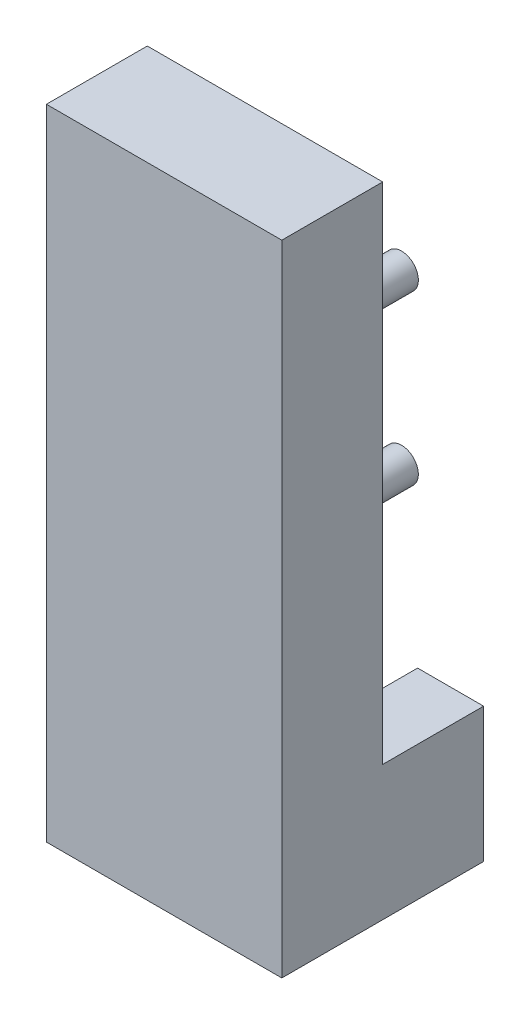
ISO-10303-21;
HEADER;
FILE_DESCRIPTION(('STEP AP214'),'2;1');
FILE_NAME('part.step','',(''),(''),'','','');
FILE_SCHEMA(('AUTOMOTIVE_DESIGN { 1 0 10303 214 1 1 1 1 }'));
ENDSEC;
DATA;
#1=APPLICATION_CONTEXT('core data for automotive mechanical design processes');
#2=APPLICATION_PROTOCOL_DEFINITION('international standard','automotive_design',2000,#1);
#3=PRODUCT_CONTEXT('',#1,'mechanical');
#4=PRODUCT('Part','Part','',(#3));
#5=PRODUCT_RELATED_PRODUCT_CATEGORY('part','',(#4));
#6=PRODUCT_DEFINITION_FORMATION('','',#4);
#7=PRODUCT_DEFINITION_CONTEXT('part definition',#1,'design');
#8=PRODUCT_DEFINITION('design','',#6,#7);
#9=PRODUCT_DEFINITION_SHAPE('','',#8);
#10=(LENGTH_UNIT() NAMED_UNIT(*) SI_UNIT(.MILLI.,.METRE.));
#11=(NAMED_UNIT(*) PLANE_ANGLE_UNIT() SI_UNIT($,.RADIAN.));
#12=(NAMED_UNIT(*) SI_UNIT($,.STERADIAN.) SOLID_ANGLE_UNIT());
#13=UNCERTAINTY_MEASURE_WITH_UNIT(LENGTH_MEASURE(1.E-05),#10,'distance_accuracy_value','');
#14=(GEOMETRIC_REPRESENTATION_CONTEXT(3) GLOBAL_UNCERTAINTY_ASSIGNED_CONTEXT((#13)) GLOBAL_UNIT_ASSIGNED_CONTEXT((#10,
#11,#12)) REPRESENTATION_CONTEXT('',''));
#15=CARTESIAN_POINT('',(0.,0.,0.));
#16=DIRECTION('',(0.,0.,1.));
#17=DIRECTION('',(1.,0.,0.));
#18=AXIS2_PLACEMENT_3D('',#15,#16,#17);
#19=CARTESIAN_POINT('',(0.,0.,0.));
#20=DIRECTION('',(0.,0.,-1.));
#21=DIRECTION('',(-1.,0.,0.));
#22=AXIS2_PLACEMENT_3D('',#19,#20,#21);
#23=PLANE('',#22);
#24=CARTESIAN_POINT('',(9.144,63.5,0.));
#25=DIRECTION('',(0.,0.,-1.));
#26=DIRECTION('',(-1.,0.,0.));
#27=AXIS2_PLACEMENT_3D('',#24,#25,#26);
#28=CIRCLE('',#27,3.175);
#29=CARTESIAN_POINT('',(5.969,63.5,0.));
#30=VERTEX_POINT('',#29);
#31=EDGE_CURVE('E471',#30,#30,#28,.T.);
#32=ORIENTED_EDGE('',*,*,#31,.F.);
#33=EDGE_LOOP('',(#32));
#34=FACE_BOUND('',#33,.T.);
#35=CARTESIAN_POINT('',(35.306,63.5,0.));
#36=DIRECTION('',(0.,0.,-1.));
#37=DIRECTION('',(-1.,0.,0.));
#38=AXIS2_PLACEMENT_3D('',#35,#36,#37);
#39=CIRCLE('',#38,3.175);
#40=CARTESIAN_POINT('',(32.131,63.5,0.));
#41=VERTEX_POINT('',#40);
#42=EDGE_CURVE('E477',#41,#41,#39,.T.);
#43=ORIENTED_EDGE('',*,*,#42,.F.);
#44=EDGE_LOOP('',(#43));
#45=FACE_BOUND('',#44,.T.);
#46=CARTESIAN_POINT('',(9.144,95.25,0.));
#47=DIRECTION('',(0.,0.,-1.));
#48=DIRECTION('',(-1.,0.,0.));
#49=AXIS2_PLACEMENT_3D('',#46,#47,#48);
#50=CIRCLE('',#49,3.175);
#51=CARTESIAN_POINT('',(5.969,95.25,0.));
#52=VERTEX_POINT('',#51);
#53=EDGE_CURVE('E483',#52,#52,#50,.T.);
#54=ORIENTED_EDGE('',*,*,#53,.F.);
#55=EDGE_LOOP('',(#54));
#56=FACE_BOUND('',#55,.T.);
#57=CARTESIAN_POINT('',(35.306,95.25,0.));
#58=DIRECTION('',(0.,0.,-1.));
#59=DIRECTION('',(-1.,0.,0.));
#60=AXIS2_PLACEMENT_3D('',#57,#58,#59);
#61=CIRCLE('',#60,3.175);
#62=CARTESIAN_POINT('',(32.131,95.25,0.));
#63=VERTEX_POINT('',#62);
#64=EDGE_CURVE('E486',#63,#63,#61,.T.);
#65=ORIENTED_EDGE('',*,*,#64,.F.);
#66=EDGE_LOOP('',(#65));
#67=FACE_BOUND('',#66,.T.);
#68=DIRECTION('',(0.,1.,0.));
#69=VECTOR('',#68,1.);
#70=CARTESIAN_POINT('',(18.1682158747707,0.,0.));
#71=LINE('',#70,#69);
#72=CARTESIAN_POINT('',(18.1682158747707,0.,0.));
#73=VERTEX_POINT('',#72);
#74=CARTESIAN_POINT('',(18.1682158747707,16.521928602913,0.));
#75=VERTEX_POINT('',#74);
#76=EDGE_CURVE('E50',#73,#75,#71,.T.);
#77=ORIENTED_EDGE('',*,*,#76,.T.);
#78=CARTESIAN_POINT('',(22.225,25.4,0.));
#79=DIRECTION('',(0.,0.,-1.));
#80=DIRECTION('',(-1.,0.,0.));
#81=AXIS2_PLACEMENT_3D('',#78,#79,#80);
#82=CIRCLE('',#81,9.76102705510475);
#83=CARTESIAN_POINT('',(12.4639729448952,25.4,0.));
#84=VERTEX_POINT('',#83);
#85=EDGE_CURVE('E130',#75,#84,#82,.T.);
#86=ORIENTED_EDGE('',*,*,#85,.T.);
#87=DIRECTION('',(-1.,0.,0.));
#88=VECTOR('',#87,1.);
#89=CARTESIAN_POINT('',(0.,25.4,0.));
#90=LINE('',#89,#88);
#91=CARTESIAN_POINT('',(0.,25.4,0.));
#92=VERTEX_POINT('',#91);
#93=EDGE_CURVE('E141',#84,#92,#90,.T.);
#94=ORIENTED_EDGE('',*,*,#93,.T.);
#95=DIRECTION('',(0.,-1.,0.));
#96=VECTOR('',#95,1.);
#97=CARTESIAN_POINT('',(0.,0.,0.));
#98=LINE('',#97,#96);
#99=CARTESIAN_POINT('',(0.,120.65,0.));
#100=VERTEX_POINT('',#99);
#101=EDGE_CURVE('E193',#100,#92,#98,.T.);
#102=ORIENTED_EDGE('',*,*,#101,.F.);
#103=DIRECTION('',(-1.,0.,0.));
#104=VECTOR('',#103,1.);
#105=CARTESIAN_POINT('',(0.,120.65,0.));
#106=LINE('',#105,#104);
#107=CARTESIAN_POINT('',(44.45,120.65,0.));
#108=VERTEX_POINT('',#107);
#109=EDGE_CURVE('E198',#108,#100,#106,.T.);
#110=ORIENTED_EDGE('',*,*,#109,.F.);
#111=DIRECTION('',(0.,1.,0.));
#112=VECTOR('',#111,1.);
#113=CARTESIAN_POINT('',(44.45,0.,0.));
#114=LINE('',#113,#112);
#115=CARTESIAN_POINT('',(44.45,25.4,0.));
#116=VERTEX_POINT('',#115);
#117=EDGE_CURVE('E209',#116,#108,#114,.T.);
#118=ORIENTED_EDGE('',*,*,#117,.F.);
#119=DIRECTION('',(1.,0.,0.));
#120=VECTOR('',#119,1.);
#121=CARTESIAN_POINT('',(0.,25.4,0.));
#122=LINE('',#121,#120);
#123=CARTESIAN_POINT('',(31.9860270551047,25.4,0.));
#124=VERTEX_POINT('',#123);
#125=EDGE_CURVE('E179',#124,#116,#122,.T.);
#126=ORIENTED_EDGE('',*,*,#125,.F.);
#127=CARTESIAN_POINT('',(22.225,25.4,0.));
#128=DIRECTION('',(0.,0.,-1.));
#129=DIRECTION('',(-1.,0.,0.));
#130=AXIS2_PLACEMENT_3D('',#127,#128,#129);
#131=CIRCLE('',#130,9.76102705510475);
#132=CARTESIAN_POINT('',(26.2817841252293,16.521928602913,0.));
#133=VERTEX_POINT('',#132);
#134=EDGE_CURVE('E58',#124,#133,#131,.T.);
#135=ORIENTED_EDGE('',*,*,#134,.T.);
#136=DIRECTION('',(0.,-1.,0.));
#137=VECTOR('',#136,1.);
#138=CARTESIAN_POINT('',(26.2817841252293,0.,0.));
#139=LINE('',#138,#137);
#140=CARTESIAN_POINT('',(26.2817841252293,0.,0.));
#141=VERTEX_POINT('',#140);
#142=EDGE_CURVE('E167',#133,#141,#139,.T.);
#143=ORIENTED_EDGE('',*,*,#142,.T.);
#144=DIRECTION('',(1.,0.,0.));
#145=VECTOR('',#144,1.);
#146=CARTESIAN_POINT('',(0.,0.,0.));
#147=LINE('',#146,#145);
#148=EDGE_CURVE('E207',#73,#141,#147,.T.);
#149=ORIENTED_EDGE('',*,*,#148,.F.);
#150=EDGE_LOOP('',(#77,#86,#94,#102,#110,#118,#126,#135,#143,#149));
#151=FACE_BOUND('',#150,.T.);
#152=ADVANCED_FACE('F35',(#34,#45,#56,#67,#151),#23,.T.);
#153=CARTESIAN_POINT('',(0.,0.,19.05));
#154=DIRECTION('',(1.,0.,0.));
#155=DIRECTION('',(0.,0.,-1.));
#156=AXIS2_PLACEMENT_3D('',#153,#154,#155);
#157=PLANE('',#156);
#158=ORIENTED_EDGE('',*,*,#101,.T.);
#159=DIRECTION('',(0.,0.,1.));
#160=VECTOR('',#159,1.);
#161=CARTESIAN_POINT('',(0.,25.4,-19.05));
#162=LINE('',#161,#160);
#163=CARTESIAN_POINT('',(0.,25.4,-19.05));
#164=VERTEX_POINT('',#163);
#165=EDGE_CURVE('E160',#164,#92,#162,.T.);
#166=ORIENTED_EDGE('',*,*,#165,.F.);
#167=DIRECTION('',(0.,1.,0.));
#168=VECTOR('',#167,1.);
#169=CARTESIAN_POINT('',(0.,0.,-19.05));
#170=LINE('',#169,#168);
#171=CARTESIAN_POINT('',(0.,0.,-19.05));
#172=VERTEX_POINT('',#171);
#173=EDGE_CURVE('E147',#172,#164,#170,.T.);
#174=ORIENTED_EDGE('',*,*,#173,.F.);
#175=DIRECTION('',(0.,0.,-1.));
#176=VECTOR('',#175,1.);
#177=CARTESIAN_POINT('',(0.,0.,19.05));
#178=LINE('',#177,#176);
#179=CARTESIAN_POINT('',(0.,0.,19.05));
#180=VERTEX_POINT('',#179);
#181=EDGE_CURVE('E11',#180,#172,#178,.T.);
#182=ORIENTED_EDGE('',*,*,#181,.F.);
#183=DIRECTION('',(0.,-1.,0.));
#184=VECTOR('',#183,1.);
#185=CARTESIAN_POINT('',(0.,0.,19.05));
#186=LINE('',#185,#184);
#187=CARTESIAN_POINT('',(0.,120.65,19.05));
#188=VERTEX_POINT('',#187);
#189=EDGE_CURVE('E194',#188,#180,#186,.T.);
#190=ORIENTED_EDGE('',*,*,#189,.F.);
#191=DIRECTION('',(0.,0.,-1.));
#192=VECTOR('',#191,1.);
#193=CARTESIAN_POINT('',(0.,120.65,19.05));
#194=LINE('',#193,#192);
#195=EDGE_CURVE('E204',#188,#100,#194,.T.);
#196=ORIENTED_EDGE('',*,*,#195,.T.);
#197=EDGE_LOOP('',(#158,#166,#174,#182,#190,#196));
#198=FACE_BOUND('',#197,.T.);
#199=ADVANCED_FACE('F37',(#198),#157,.F.);
#200=CARTESIAN_POINT('',(0.,0.,19.05));
#201=DIRECTION('',(0.,1.,0.));
#202=DIRECTION('',(0.,0.,1.));
#203=AXIS2_PLACEMENT_3D('',#200,#201,#202);
#204=PLANE('',#203);
#205=ORIENTED_EDGE('',*,*,#181,.T.);
#206=DIRECTION('',(-1.,0.,0.));
#207=VECTOR('',#206,1.);
#208=CARTESIAN_POINT('',(0.,0.,-19.05));
#209=LINE('',#208,#207);
#210=CARTESIAN_POINT('',(18.1682158747707,0.,-19.05));
#211=VERTEX_POINT('',#210);
#212=EDGE_CURVE('E145',#211,#172,#209,.T.);
#213=ORIENTED_EDGE('',*,*,#212,.F.);
#214=DIRECTION('',(0.,0.,1.));
#215=VECTOR('',#214,1.);
#216=CARTESIAN_POINT('',(18.1682158747707,0.,-19.05));
#217=LINE('',#216,#215);
#218=EDGE_CURVE('E132',#211,#73,#217,.T.);
#219=ORIENTED_EDGE('',*,*,#218,.T.);
#220=ORIENTED_EDGE('',*,*,#148,.T.);
#221=DIRECTION('',(0.,0.,1.));
#222=VECTOR('',#221,1.);
#223=CARTESIAN_POINT('',(26.2817841252293,0.,-19.05));
#224=LINE('',#223,#222);
#225=CARTESIAN_POINT('',(26.2817841252293,0.,-19.05));
#226=VERTEX_POINT('',#225);
#227=EDGE_CURVE('E184',#226,#141,#224,.T.);
#228=ORIENTED_EDGE('',*,*,#227,.F.);
#229=DIRECTION('',(-1.,0.,0.));
#230=VECTOR('',#229,1.);
#231=CARTESIAN_POINT('',(0.,0.,-19.05));
#232=LINE('',#231,#230);
#233=CARTESIAN_POINT('',(44.45,0.,-19.05));
#234=VERTEX_POINT('',#233);
#235=EDGE_CURVE('E172',#234,#226,#232,.T.);
#236=ORIENTED_EDGE('',*,*,#235,.F.);
#237=DIRECTION('',(0.,0.,-1.));
#238=VECTOR('',#237,1.);
#239=CARTESIAN_POINT('',(44.45,0.,19.05));
#240=LINE('',#239,#238);
#241=CARTESIAN_POINT('',(44.45,0.,19.05));
#242=VERTEX_POINT('',#241);
#243=EDGE_CURVE('E43',#242,#234,#240,.T.);
#244=ORIENTED_EDGE('',*,*,#243,.F.);
#245=DIRECTION('',(1.,0.,0.));
#246=VECTOR('',#245,1.);
#247=CARTESIAN_POINT('',(0.,0.,19.05));
#248=LINE('',#247,#246);
#249=EDGE_CURVE('E197',#180,#242,#248,.T.);
#250=ORIENTED_EDGE('',*,*,#249,.F.);
#251=EDGE_LOOP('',(#205,#213,#219,#220,#228,#236,#244,#250));
#252=FACE_BOUND('',#251,.T.);
#253=ADVANCED_FACE('F231',(#252),#204,.F.);
#254=CARTESIAN_POINT('',(44.45,0.,19.05));
#255=DIRECTION('',(-1.,0.,0.));
#256=DIRECTION('',(0.,0.,1.));
#257=AXIS2_PLACEMENT_3D('',#254,#255,#256);
#258=PLANE('',#257);
#259=ORIENTED_EDGE('',*,*,#243,.T.);
#260=DIRECTION('',(0.,-1.,0.));
#261=VECTOR('',#260,1.);
#262=CARTESIAN_POINT('',(44.45,0.,-19.05));
#263=LINE('',#262,#261);
#264=CARTESIAN_POINT('',(44.45,25.4,-19.05));
#265=VERTEX_POINT('',#264);
#266=EDGE_CURVE('E169',#265,#234,#263,.T.);
#267=ORIENTED_EDGE('',*,*,#266,.F.);
#268=DIRECTION('',(0.,0.,1.));
#269=VECTOR('',#268,1.);
#270=CARTESIAN_POINT('',(44.45,25.4,-19.05));
#271=LINE('',#270,#269);
#272=EDGE_CURVE('E187',#265,#116,#271,.T.);
#273=ORIENTED_EDGE('',*,*,#272,.T.);
#274=ORIENTED_EDGE('',*,*,#117,.T.);
#275=DIRECTION('',(0.,0.,-1.));
#276=VECTOR('',#275,1.);
#277=CARTESIAN_POINT('',(44.45,120.65,19.05));
#278=LINE('',#277,#276);
#279=CARTESIAN_POINT('',(44.45,120.65,19.05));
#280=VERTEX_POINT('',#279);
#281=EDGE_CURVE('E214',#280,#108,#278,.T.);
#282=ORIENTED_EDGE('',*,*,#281,.F.);
#283=DIRECTION('',(0.,1.,0.));
#284=VECTOR('',#283,1.);
#285=CARTESIAN_POINT('',(44.45,0.,19.05));
#286=LINE('',#285,#284);
#287=EDGE_CURVE('E200',#242,#280,#286,.T.);
#288=ORIENTED_EDGE('',*,*,#287,.F.);
#289=EDGE_LOOP('',(#259,#267,#273,#274,#282,#288));
#290=FACE_BOUND('',#289,.T.);
#291=ADVANCED_FACE('F220',(#290),#258,.F.);
#292=CARTESIAN_POINT('',(0.,120.65,19.05));
#293=DIRECTION('',(0.,-1.,0.));
#294=DIRECTION('',(1.,0.,0.));
#295=AXIS2_PLACEMENT_3D('',#292,#293,#294);
#296=PLANE('',#295);
#297=ORIENTED_EDGE('',*,*,#109,.T.);
#298=ORIENTED_EDGE('',*,*,#195,.F.);
#299=DIRECTION('',(-1.,0.,0.));
#300=VECTOR('',#299,1.);
#301=CARTESIAN_POINT('',(0.,120.65,19.05));
#302=LINE('',#301,#300);
#303=EDGE_CURVE('E202',#280,#188,#302,.T.);
#304=ORIENTED_EDGE('',*,*,#303,.F.);
#305=ORIENTED_EDGE('',*,*,#281,.T.);
#306=EDGE_LOOP('',(#297,#298,#304,#305));
#307=FACE_BOUND('',#306,.T.);
#308=ADVANCED_FACE('F243',(#307),#296,.F.);
#309=CARTESIAN_POINT('',(0.,0.,19.05));
#310=DIRECTION('',(0.,0.,-1.));
#311=DIRECTION('',(-1.,0.,0.));
#312=AXIS2_PLACEMENT_3D('',#309,#310,#311);
#313=PLANE('',#312);
#314=ORIENTED_EDGE('',*,*,#189,.T.);
#315=ORIENTED_EDGE('',*,*,#249,.T.);
#316=ORIENTED_EDGE('',*,*,#287,.T.);
#317=ORIENTED_EDGE('',*,*,#303,.T.);
#318=EDGE_LOOP('',(#314,#315,#316,#317));
#319=FACE_BOUND('',#318,.T.);
#320=ADVANCED_FACE('F253',(#319),#313,.F.);
#321=CARTESIAN_POINT('',(22.225,25.4,-19.05));
#322=DIRECTION('',(0.,0.,1.));
#323=DIRECTION('',(1.,0.,0.));
#324=AXIS2_PLACEMENT_3D('',#321,#322,#323);
#325=CYLINDRICAL_SURFACE('',#324,9.76102705510475);
#326=ORIENTED_EDGE('',*,*,#134,.F.);
#327=DIRECTION('',(0.,0.,1.));
#328=VECTOR('',#327,1.);
#329=CARTESIAN_POINT('',(31.9860270551047,25.4,-19.05));
#330=LINE('',#329,#328);
#331=CARTESIAN_POINT('',(31.9860270551047,25.4,-19.05));
#332=VERTEX_POINT('',#331);
#333=EDGE_CURVE('E190',#332,#124,#330,.T.);
#334=ORIENTED_EDGE('',*,*,#333,.F.);
#335=CARTESIAN_POINT('',(22.225,25.4,-19.05));
#336=DIRECTION('',(0.,0.,-1.));
#337=DIRECTION('',(-1.,0.,0.));
#338=AXIS2_PLACEMENT_3D('',#335,#336,#337);
#339=CIRCLE('',#338,9.76102705510475);
#340=CARTESIAN_POINT('',(26.2817841252293,16.521928602913,-19.05));
#341=VERTEX_POINT('',#340);
#342=EDGE_CURVE('E163',#332,#341,#339,.T.);
#343=ORIENTED_EDGE('',*,*,#342,.T.);
#344=DIRECTION('',(0.,0.,1.));
#345=VECTOR('',#344,1.);
#346=CARTESIAN_POINT('',(26.2817841252293,16.521928602913,-19.05));
#347=LINE('',#346,#345);
#348=EDGE_CURVE('E177',#341,#133,#347,.T.);
#349=ORIENTED_EDGE('',*,*,#348,.T.);
#350=EDGE_LOOP('',(#326,#334,#343,#349));
#351=FACE_BOUND('',#350,.T.);
#352=ADVANCED_FACE('F237',(#351),#325,.F.);
#353=CARTESIAN_POINT('',(0.,25.4,-19.05));
#354=DIRECTION('',(0.,-1.,0.));
#355=DIRECTION('',(1.,0.,0.));
#356=AXIS2_PLACEMENT_3D('',#353,#354,#355);
#357=PLANE('',#356);
#358=ORIENTED_EDGE('',*,*,#125,.T.);
#359=ORIENTED_EDGE('',*,*,#272,.F.);
#360=DIRECTION('',(1.,0.,0.));
#361=VECTOR('',#360,1.);
#362=CARTESIAN_POINT('',(0.,25.4,-19.05));
#363=LINE('',#362,#361);
#364=EDGE_CURVE('E166',#332,#265,#363,.T.);
#365=ORIENTED_EDGE('',*,*,#364,.F.);
#366=ORIENTED_EDGE('',*,*,#333,.T.);
#367=EDGE_LOOP('',(#358,#359,#365,#366));
#368=FACE_BOUND('',#367,.T.);
#369=ADVANCED_FACE('F239',(#368),#357,.F.);
#370=CARTESIAN_POINT('',(26.2817841252293,0.,-19.05));
#371=DIRECTION('',(-1.,0.,0.));
#372=DIRECTION('',(0.,0.,1.));
#373=AXIS2_PLACEMENT_3D('',#370,#371,#372);
#374=PLANE('',#373);
#375=ORIENTED_EDGE('',*,*,#142,.F.);
#376=ORIENTED_EDGE('',*,*,#348,.F.);
#377=DIRECTION('',(0.,-1.,0.));
#378=VECTOR('',#377,1.);
#379=CARTESIAN_POINT('',(26.2817841252293,0.,-19.05));
#380=LINE('',#379,#378);
#381=EDGE_CURVE('E174',#341,#226,#380,.T.);
#382=ORIENTED_EDGE('',*,*,#381,.T.);
#383=ORIENTED_EDGE('',*,*,#227,.T.);
#384=EDGE_LOOP('',(#375,#376,#382,#383));
#385=FACE_BOUND('',#384,.T.);
#386=ADVANCED_FACE('F235',(#385),#374,.T.);
#387=CARTESIAN_POINT('',(0.,0.,-19.05));
#388=DIRECTION('',(0.,0.,-1.));
#389=DIRECTION('',(-1.,0.,0.));
#390=AXIS2_PLACEMENT_3D('',#387,#388,#389);
#391=PLANE('',#390);
#392=ORIENTED_EDGE('',*,*,#342,.F.);
#393=ORIENTED_EDGE('',*,*,#364,.T.);
#394=ORIENTED_EDGE('',*,*,#266,.T.);
#395=ORIENTED_EDGE('',*,*,#235,.T.);
#396=ORIENTED_EDGE('',*,*,#381,.F.);
#397=EDGE_LOOP('',(#392,#393,#394,#395,#396));
#398=FACE_BOUND('',#397,.T.);
#399=ADVANCED_FACE('F226',(#398),#391,.T.);
#400=CARTESIAN_POINT('',(22.225,25.4,-19.05));
#401=DIRECTION('',(0.,0.,1.));
#402=DIRECTION('',(1.,0.,0.));
#403=AXIS2_PLACEMENT_3D('',#400,#401,#402);
#404=CYLINDRICAL_SURFACE('',#403,9.76102705510475);
#405=ORIENTED_EDGE('',*,*,#85,.F.);
#406=DIRECTION('',(0.,0.,1.));
#407=VECTOR('',#406,1.);
#408=CARTESIAN_POINT('',(18.1682158747707,16.521928602913,-19.05));
#409=LINE('',#408,#407);
#410=CARTESIAN_POINT('',(18.1682158747707,16.521928602913,-19.05));
#411=VERTEX_POINT('',#410);
#412=EDGE_CURVE('E124',#411,#75,#409,.T.);
#413=ORIENTED_EDGE('',*,*,#412,.F.);
#414=CARTESIAN_POINT('',(22.225,25.4,-19.05));
#415=DIRECTION('',(0.,0.,-1.));
#416=DIRECTION('',(-1.,0.,0.));
#417=AXIS2_PLACEMENT_3D('',#414,#415,#416);
#418=CIRCLE('',#417,9.76102705510475);
#419=CARTESIAN_POINT('',(12.4639729448952,25.4,-19.05));
#420=VERTEX_POINT('',#419);
#421=EDGE_CURVE('E127',#411,#420,#418,.T.);
#422=ORIENTED_EDGE('',*,*,#421,.T.);
#423=DIRECTION('',(0.,0.,1.));
#424=VECTOR('',#423,1.);
#425=CARTESIAN_POINT('',(12.4639729448952,25.4,-19.05));
#426=LINE('',#425,#424);
#427=EDGE_CURVE('E153',#420,#84,#426,.T.);
#428=ORIENTED_EDGE('',*,*,#427,.T.);
#429=EDGE_LOOP('',(#405,#413,#422,#428));
#430=FACE_BOUND('',#429,.T.);
#431=ADVANCED_FACE('F126',(#430),#404,.F.);
#432=CARTESIAN_POINT('',(18.1682158747707,0.,-19.05));
#433=DIRECTION('',(1.,0.,0.));
#434=DIRECTION('',(0.,0.,-1.));
#435=AXIS2_PLACEMENT_3D('',#432,#433,#434);
#436=PLANE('',#435);
#437=ORIENTED_EDGE('',*,*,#76,.F.);
#438=ORIENTED_EDGE('',*,*,#218,.F.);
#439=DIRECTION('',(0.,1.,0.));
#440=VECTOR('',#439,1.);
#441=CARTESIAN_POINT('',(18.1682158747707,0.,-19.05));
#442=LINE('',#441,#440);
#443=EDGE_CURVE('E138',#211,#411,#442,.T.);
#444=ORIENTED_EDGE('',*,*,#443,.T.);
#445=ORIENTED_EDGE('',*,*,#412,.T.);
#446=EDGE_LOOP('',(#437,#438,#444,#445));
#447=FACE_BOUND('',#446,.T.);
#448=ADVANCED_FACE('F143',(#447),#436,.T.);
#449=CARTESIAN_POINT('',(0.,25.4,-19.05));
#450=DIRECTION('',(0.,1.,0.));
#451=DIRECTION('',(-1.,0.,0.));
#452=AXIS2_PLACEMENT_3D('',#449,#450,#451);
#453=PLANE('',#452);
#454=ORIENTED_EDGE('',*,*,#93,.F.);
#455=ORIENTED_EDGE('',*,*,#427,.F.);
#456=DIRECTION('',(-1.,0.,0.));
#457=VECTOR('',#456,1.);
#458=CARTESIAN_POINT('',(0.,25.4,-19.05));
#459=LINE('',#458,#457);
#460=EDGE_CURVE('E140',#420,#164,#459,.T.);
#461=ORIENTED_EDGE('',*,*,#460,.T.);
#462=ORIENTED_EDGE('',*,*,#165,.T.);
#463=EDGE_LOOP('',(#454,#455,#461,#462));
#464=FACE_BOUND('',#463,.T.);
#465=ADVANCED_FACE('F363',(#464),#453,.T.);
#466=CARTESIAN_POINT('',(0.,0.,-19.05));
#467=DIRECTION('',(0.,0.,-1.));
#468=DIRECTION('',(-1.,0.,0.));
#469=AXIS2_PLACEMENT_3D('',#466,#467,#468);
#470=PLANE('',#469);
#471=ORIENTED_EDGE('',*,*,#421,.F.);
#472=ORIENTED_EDGE('',*,*,#443,.F.);
#473=ORIENTED_EDGE('',*,*,#212,.T.);
#474=ORIENTED_EDGE('',*,*,#173,.T.);
#475=ORIENTED_EDGE('',*,*,#460,.F.);
#476=EDGE_LOOP('',(#471,#472,#473,#474,#475));
#477=FACE_BOUND('',#476,.T.);
#478=ADVANCED_FACE('F136',(#477),#470,.T.);
#479=CARTESIAN_POINT('',(35.306,95.25,-12.7));
#480=DIRECTION('',(0.,0.,1.));
#481=DIRECTION('',(1.,0.,0.));
#482=AXIS2_PLACEMENT_3D('',#479,#480,#481);
#483=CYLINDRICAL_SURFACE('',#482,3.175);
#484=CARTESIAN_POINT('',(35.306,95.25,-12.7));
#485=DIRECTION('',(0.,0.,-1.));
#486=DIRECTION('',(-1.,0.,0.));
#487=AXIS2_PLACEMENT_3D('',#484,#485,#486);
#488=CIRCLE('',#487,3.175);
#489=CARTESIAN_POINT('',(32.131,95.25,-12.7));
#490=VERTEX_POINT('',#489);
#491=EDGE_CURVE('E155',#490,#490,#488,.T.);
#492=ORIENTED_EDGE('',*,*,#491,.F.);
#493=EDGE_LOOP('',(#492));
#494=FACE_BOUND('',#493,.T.);
#495=ORIENTED_EDGE('',*,*,#64,.T.);
#496=EDGE_LOOP('',(#495));
#497=FACE_BOUND('',#496,.T.);
#498=ADVANCED_FACE('F379',(#494,#497),#483,.T.);
#499=CARTESIAN_POINT('',(0.,0.,-12.7));
#500=DIRECTION('',(0.,0.,-1.));
#501=DIRECTION('',(-1.,0.,0.));
#502=AXIS2_PLACEMENT_3D('',#499,#500,#501);
#503=PLANE('',#502);
#504=ORIENTED_EDGE('',*,*,#491,.T.);
#505=EDGE_LOOP('',(#504));
#506=FACE_BOUND('',#505,.T.);
#507=ADVANCED_FACE('F387',(#506),#503,.T.);
#508=CARTESIAN_POINT('',(9.144,95.25,-12.7));
#509=DIRECTION('',(0.,0.,1.));
#510=DIRECTION('',(1.,0.,0.));
#511=AXIS2_PLACEMENT_3D('',#508,#509,#510);
#512=CYLINDRICAL_SURFACE('',#511,3.175);
#513=CARTESIAN_POINT('',(9.144,95.25,-12.7));
#514=DIRECTION('',(0.,0.,-1.));
#515=DIRECTION('',(-1.,0.,0.));
#516=AXIS2_PLACEMENT_3D('',#513,#514,#515);
#517=CIRCLE('',#516,3.175);
#518=CARTESIAN_POINT('',(5.969,95.25,-12.7));
#519=VERTEX_POINT('',#518);
#520=EDGE_CURVE('E480',#519,#519,#517,.T.);
#521=ORIENTED_EDGE('',*,*,#520,.F.);
#522=EDGE_LOOP('',(#521));
#523=FACE_BOUND('',#522,.T.);
#524=ORIENTED_EDGE('',*,*,#53,.T.);
#525=EDGE_LOOP('',(#524));
#526=FACE_BOUND('',#525,.T.);
#527=ADVANCED_FACE('F396',(#523,#526),#512,.T.);
#528=CARTESIAN_POINT('',(0.,0.,-12.7));
#529=DIRECTION('',(0.,0.,-1.));
#530=DIRECTION('',(-1.,0.,0.));
#531=AXIS2_PLACEMENT_3D('',#528,#529,#530);
#532=PLANE('',#531);
#533=ORIENTED_EDGE('',*,*,#520,.T.);
#534=EDGE_LOOP('',(#533));
#535=FACE_BOUND('',#534,.T.);
#536=ADVANCED_FACE('F405',(#535),#532,.T.);
#537=CARTESIAN_POINT('',(35.306,63.5,-12.7));
#538=DIRECTION('',(0.,0.,1.));
#539=DIRECTION('',(1.,0.,0.));
#540=AXIS2_PLACEMENT_3D('',#537,#538,#539);
#541=CYLINDRICAL_SURFACE('',#540,3.175);
#542=CARTESIAN_POINT('',(35.306,63.5,-12.7));
#543=DIRECTION('',(0.,0.,-1.));
#544=DIRECTION('',(-1.,0.,0.));
#545=AXIS2_PLACEMENT_3D('',#542,#543,#544);
#546=CIRCLE('',#545,3.175);
#547=CARTESIAN_POINT('',(32.131,63.5,-12.7));
#548=VERTEX_POINT('',#547);
#549=EDGE_CURVE('E474',#548,#548,#546,.T.);
#550=ORIENTED_EDGE('',*,*,#549,.F.);
#551=EDGE_LOOP('',(#550));
#552=FACE_BOUND('',#551,.T.);
#553=ORIENTED_EDGE('',*,*,#42,.T.);
#554=EDGE_LOOP('',(#553));
#555=FACE_BOUND('',#554,.T.);
#556=ADVANCED_FACE('F414',(#552,#555),#541,.T.);
#557=CARTESIAN_POINT('',(0.,0.,-12.7));
#558=DIRECTION('',(0.,0.,-1.));
#559=DIRECTION('',(-1.,0.,0.));
#560=AXIS2_PLACEMENT_3D('',#557,#558,#559);
#561=PLANE('',#560);
#562=ORIENTED_EDGE('',*,*,#549,.T.);
#563=EDGE_LOOP('',(#562));
#564=FACE_BOUND('',#563,.T.);
#565=ADVANCED_FACE('F423',(#564),#561,.T.);
#566=CARTESIAN_POINT('',(9.144,63.5,-12.7));
#567=DIRECTION('',(0.,0.,1.));
#568=DIRECTION('',(1.,0.,0.));
#569=AXIS2_PLACEMENT_3D('',#566,#567,#568);
#570=CYLINDRICAL_SURFACE('',#569,3.175);
#571=CARTESIAN_POINT('',(9.144,63.5,-12.7));
#572=DIRECTION('',(0.,0.,-1.));
#573=DIRECTION('',(-1.,0.,0.));
#574=AXIS2_PLACEMENT_3D('',#571,#572,#573);
#575=CIRCLE('',#574,3.175);
#576=CARTESIAN_POINT('',(5.969,63.5,-12.7));
#577=VERTEX_POINT('',#576);
#578=EDGE_CURVE('E470',#577,#577,#575,.T.);
#579=ORIENTED_EDGE('',*,*,#578,.F.);
#580=EDGE_LOOP('',(#579));
#581=FACE_BOUND('',#580,.T.);
#582=ORIENTED_EDGE('',*,*,#31,.T.);
#583=EDGE_LOOP('',(#582));
#584=FACE_BOUND('',#583,.T.);
#585=ADVANCED_FACE('F432',(#581,#584),#570,.T.);
#586=CARTESIAN_POINT('',(9.144,63.5,-12.7));
#587=DIRECTION('',(0.,0.,-1.));
#588=DIRECTION('',(-1.,0.,0.));
#589=AXIS2_PLACEMENT_3D('',#586,#587,#588);
#590=PLANE('',#589);
#591=ORIENTED_EDGE('',*,*,#578,.T.);
#592=EDGE_LOOP('',(#591));
#593=FACE_BOUND('',#592,.T.);
#594=ADVANCED_FACE('F441',(#593),#590,.T.);
#595=CLOSED_SHELL('',(#152,#199,#253,#291,#308,#320,#352,#369,#386,#399,#431,#448,#465,#478,
#498,#507,#527,#536,#556,#565,#585,#594));
#596=MANIFOLD_SOLID_BREP('B2',#595);
#597=ADVANCED_BREP_SHAPE_REPRESENTATION('',(#18,#596),#14);
#598=SHAPE_DEFINITION_REPRESENTATION(#9,#597);
ENDSEC;
END-ISO-10303-21;
